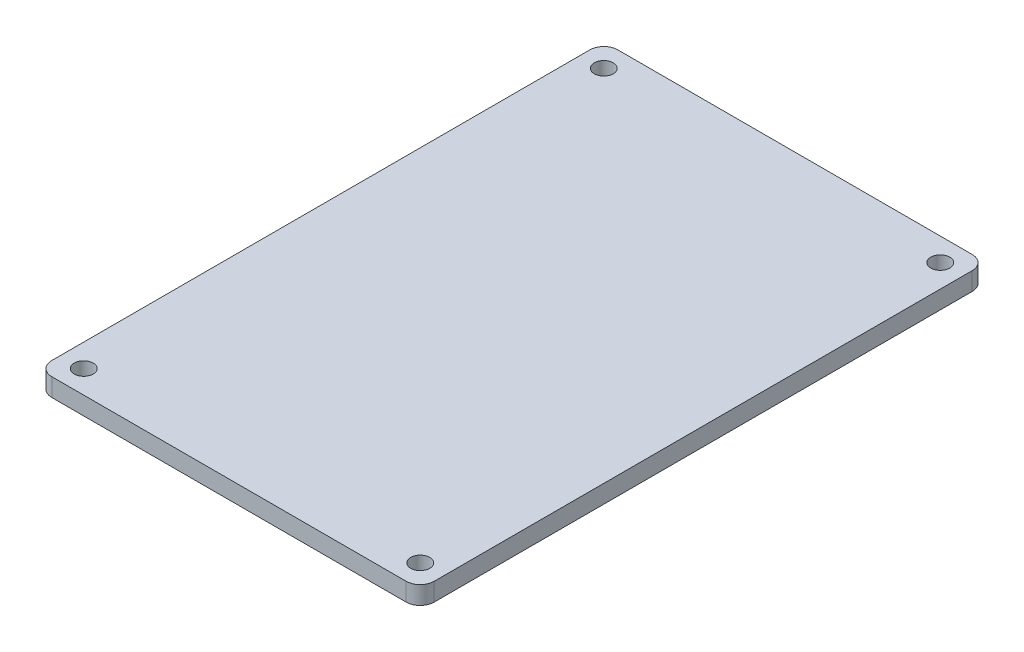
ISO-10303-21;
HEADER;
FILE_DESCRIPTION(('STEP AP214'),'2;1');
FILE_NAME('part.step','',(''),(''),'','','');
FILE_SCHEMA(('AUTOMOTIVE_DESIGN { 1 0 10303 214 1 1 1 1 }'));
ENDSEC;
DATA;
#1=APPLICATION_CONTEXT('core data for automotive mechanical design processes');
#2=APPLICATION_PROTOCOL_DEFINITION('international standard','automotive_design',2000,#1);
#3=PRODUCT_CONTEXT('',#1,'mechanical');
#4=PRODUCT('Part','Part','',(#3));
#5=PRODUCT_RELATED_PRODUCT_CATEGORY('part','',(#4));
#6=PRODUCT_DEFINITION_FORMATION('','',#4);
#7=PRODUCT_DEFINITION_CONTEXT('part definition',#1,'design');
#8=PRODUCT_DEFINITION('design','',#6,#7);
#9=PRODUCT_DEFINITION_SHAPE('','',#8);
#10=(LENGTH_UNIT() NAMED_UNIT(*) SI_UNIT(.MILLI.,.METRE.));
#11=(NAMED_UNIT(*) PLANE_ANGLE_UNIT() SI_UNIT($,.RADIAN.));
#12=(NAMED_UNIT(*) SI_UNIT($,.STERADIAN.) SOLID_ANGLE_UNIT());
#13=UNCERTAINTY_MEASURE_WITH_UNIT(LENGTH_MEASURE(1.E-05),#10,'distance_accuracy_value','');
#14=(GEOMETRIC_REPRESENTATION_CONTEXT(3) GLOBAL_UNCERTAINTY_ASSIGNED_CONTEXT((#13)) GLOBAL_UNIT_ASSIGNED_CONTEXT((#10,
#11,#12)) REPRESENTATION_CONTEXT('',''));
#15=CARTESIAN_POINT('',(0.,0.,0.));
#16=DIRECTION('',(0.,0.,1.));
#17=DIRECTION('',(1.,0.,0.));
#18=AXIS2_PLACEMENT_3D('',#15,#16,#17);
#19=CARTESIAN_POINT('',(-29.43,3.,44.68));
#20=DIRECTION('',(0.,-1.,0.));
#21=DIRECTION('',(0.,0.,-1.));
#22=AXIS2_PLACEMENT_3D('',#19,#20,#21);
#23=PLANE('',#22);
#24=CARTESIAN_POINT('',(27.94,3.,-43.18));
#25=DIRECTION('',(0.,1.,0.));
#26=DIRECTION('',(0.,0.,1.));
#27=AXIS2_PLACEMENT_3D('',#24,#25,#26);
#28=CIRCLE('',#27,1.58);
#29=CARTESIAN_POINT('',(27.94,3.,-41.6));
#30=VERTEX_POINT('',#29);
#31=EDGE_CURVE('E236',#30,#30,#28,.T.);
#32=ORIENTED_EDGE('',*,*,#31,.F.);
#33=EDGE_LOOP('',(#32));
#34=FACE_BOUND('',#33,.T.);
#35=CARTESIAN_POINT('',(-27.94,3.,-43.18));
#36=DIRECTION('',(0.,1.,0.));
#37=DIRECTION('',(0.,0.,1.));
#38=AXIS2_PLACEMENT_3D('',#35,#36,#37);
#39=CIRCLE('',#38,1.58);
#40=CARTESIAN_POINT('',(-27.94,3.,-41.6));
#41=VERTEX_POINT('',#40);
#42=EDGE_CURVE('E228',#41,#41,#39,.T.);
#43=ORIENTED_EDGE('',*,*,#42,.F.);
#44=EDGE_LOOP('',(#43));
#45=FACE_BOUND('',#44,.T.);
#46=CARTESIAN_POINT('',(27.94,3.,43.18));
#47=DIRECTION('',(0.,1.,0.));
#48=DIRECTION('',(0.,0.,1.));
#49=AXIS2_PLACEMENT_3D('',#46,#47,#48);
#50=CIRCLE('',#49,1.58);
#51=CARTESIAN_POINT('',(27.94,3.,44.76));
#52=VERTEX_POINT('',#51);
#53=EDGE_CURVE('E212',#52,#52,#50,.T.);
#54=ORIENTED_EDGE('',*,*,#53,.F.);
#55=EDGE_LOOP('',(#54));
#56=FACE_BOUND('',#55,.T.);
#57=CARTESIAN_POINT('',(-29.43,3.,44.68));
#58=DIRECTION('',(0.,1.,0.));
#59=DIRECTION('',(0.,0.,-1.));
#60=AXIS2_PLACEMENT_3D('',#57,#58,#59);
#61=CIRCLE('',#60,2.32);
#62=CARTESIAN_POINT('',(-31.75,3.,44.68));
#63=VERTEX_POINT('',#62);
#64=CARTESIAN_POINT('',(-29.43,3.,47.));
#65=VERTEX_POINT('',#64);
#66=EDGE_CURVE('E164',#63,#65,#61,.T.);
#67=ORIENTED_EDGE('',*,*,#66,.T.);
#68=DIRECTION('',(1.,0.,0.));
#69=VECTOR('',#68,1.);
#70=CARTESIAN_POINT('',(-29.43,3.,47.));
#71=LINE('',#70,#69);
#72=CARTESIAN_POINT('',(29.43,3.,47.));
#73=VERTEX_POINT('',#72);
#74=EDGE_CURVE('E100',#65,#73,#71,.T.);
#75=ORIENTED_EDGE('',*,*,#74,.T.);
#76=CARTESIAN_POINT('',(29.43,3.,44.68));
#77=DIRECTION('',(0.,1.,0.));
#78=DIRECTION('',(0.,0.,1.));
#79=AXIS2_PLACEMENT_3D('',#76,#77,#78);
#80=CIRCLE('',#79,2.32);
#81=CARTESIAN_POINT('',(31.75,3.,44.68));
#82=VERTEX_POINT('',#81);
#83=EDGE_CURVE('E185',#73,#82,#80,.T.);
#84=ORIENTED_EDGE('',*,*,#83,.T.);
#85=DIRECTION('',(0.,0.,-1.));
#86=VECTOR('',#85,1.);
#87=CARTESIAN_POINT('',(31.75,3.,44.68));
#88=LINE('',#87,#86);
#89=CARTESIAN_POINT('',(31.75,3.,-44.68));
#90=VERTEX_POINT('',#89);
#91=EDGE_CURVE('E199',#82,#90,#88,.T.);
#92=ORIENTED_EDGE('',*,*,#91,.T.);
#93=CARTESIAN_POINT('',(29.43,3.,-44.68));
#94=DIRECTION('',(0.,1.,0.));
#95=DIRECTION('',(0.,0.,-1.));
#96=AXIS2_PLACEMENT_3D('',#93,#94,#95);
#97=CIRCLE('',#96,2.32);
#98=CARTESIAN_POINT('',(29.43,3.,-47.));
#99=VERTEX_POINT('',#98);
#100=EDGE_CURVE('E119',#90,#99,#97,.T.);
#101=ORIENTED_EDGE('',*,*,#100,.T.);
#102=DIRECTION('',(-1.,0.,0.));
#103=VECTOR('',#102,1.);
#104=CARTESIAN_POINT('',(-29.43,3.,-47.));
#105=LINE('',#104,#103);
#106=CARTESIAN_POINT('',(-29.43,3.,-47.));
#107=VERTEX_POINT('',#106);
#108=EDGE_CURVE('E113',#99,#107,#105,.T.);
#109=ORIENTED_EDGE('',*,*,#108,.T.);
#110=CARTESIAN_POINT('',(-29.43,3.,-44.68));
#111=DIRECTION('',(0.,1.,0.));
#112=DIRECTION('',(0.,0.,1.));
#113=AXIS2_PLACEMENT_3D('',#110,#111,#112);
#114=CIRCLE('',#113,2.32);
#115=CARTESIAN_POINT('',(-31.75,3.,-44.68));
#116=VERTEX_POINT('',#115);
#117=EDGE_CURVE('E117',#107,#116,#114,.T.);
#118=ORIENTED_EDGE('',*,*,#117,.T.);
#119=DIRECTION('',(0.,0.,1.));
#120=VECTOR('',#119,1.);
#121=CARTESIAN_POINT('',(-31.75,3.,44.68));
#122=LINE('',#121,#120);
#123=EDGE_CURVE('E57',#116,#63,#122,.T.);
#124=ORIENTED_EDGE('',*,*,#123,.T.);
#125=EDGE_LOOP('',(#67,#75,#84,#92,#101,#109,#118,#124));
#126=FACE_BOUND('',#125,.T.);
#127=CARTESIAN_POINT('',(-27.94,3.,43.18));
#128=DIRECTION('',(0.,1.,0.));
#129=DIRECTION('',(0.,0.,1.));
#130=AXIS2_PLACEMENT_3D('',#127,#128,#129);
#131=CIRCLE('',#130,1.58);
#132=CARTESIAN_POINT('',(-27.94,3.,44.76));
#133=VERTEX_POINT('',#132);
#134=EDGE_CURVE('E220',#133,#133,#131,.T.);
#135=ORIENTED_EDGE('',*,*,#134,.F.);
#136=EDGE_LOOP('',(#135));
#137=FACE_BOUND('',#136,.T.);
#138=ADVANCED_FACE('F39',(#34,#45,#56,#126,#137),#23,.F.);
#139=CARTESIAN_POINT('',(-29.43,0.,44.68));
#140=DIRECTION('',(0.,-1.,0.));
#141=DIRECTION('',(0.,0.,-1.));
#142=AXIS2_PLACEMENT_3D('',#139,#140,#141);
#143=PLANE('',#142);
#144=CARTESIAN_POINT('',(27.94,0.,-43.18));
#145=DIRECTION('',(0.,1.,0.));
#146=DIRECTION('',(0.,0.,1.));
#147=AXIS2_PLACEMENT_3D('',#144,#145,#146);
#148=CIRCLE('',#147,1.58);
#149=CARTESIAN_POINT('',(27.94,0.,-41.6));
#150=VERTEX_POINT('',#149);
#151=EDGE_CURVE('E232',#150,#150,#148,.T.);
#152=ORIENTED_EDGE('',*,*,#151,.T.);
#153=EDGE_LOOP('',(#152));
#154=FACE_BOUND('',#153,.T.);
#155=CARTESIAN_POINT('',(-27.94,0.,-43.18));
#156=DIRECTION('',(0.,1.,0.));
#157=DIRECTION('',(0.,0.,1.));
#158=AXIS2_PLACEMENT_3D('',#155,#156,#157);
#159=CIRCLE('',#158,1.58);
#160=CARTESIAN_POINT('',(-27.94,0.,-41.6));
#161=VERTEX_POINT('',#160);
#162=EDGE_CURVE('E224',#161,#161,#159,.T.);
#163=ORIENTED_EDGE('',*,*,#162,.T.);
#164=EDGE_LOOP('',(#163));
#165=FACE_BOUND('',#164,.T.);
#166=CARTESIAN_POINT('',(-27.94,0.,43.18));
#167=DIRECTION('',(0.,1.,0.));
#168=DIRECTION('',(0.,0.,1.));
#169=AXIS2_PLACEMENT_3D('',#166,#167,#168);
#170=CIRCLE('',#169,1.58);
#171=CARTESIAN_POINT('',(-27.94,0.,44.76));
#172=VERTEX_POINT('',#171);
#173=EDGE_CURVE('E216',#172,#172,#170,.T.);
#174=ORIENTED_EDGE('',*,*,#173,.T.);
#175=EDGE_LOOP('',(#174));
#176=FACE_BOUND('',#175,.T.);
#177=CARTESIAN_POINT('',(-29.43,0.,44.68));
#178=DIRECTION('',(0.,1.,0.));
#179=DIRECTION('',(0.,0.,-1.));
#180=AXIS2_PLACEMENT_3D('',#177,#178,#179);
#181=CIRCLE('',#180,2.32);
#182=CARTESIAN_POINT('',(-31.75,0.,44.68));
#183=VERTEX_POINT('',#182);
#184=CARTESIAN_POINT('',(-29.43,0.,47.));
#185=VERTEX_POINT('',#184);
#186=EDGE_CURVE('E141',#183,#185,#181,.T.);
#187=ORIENTED_EDGE('',*,*,#186,.F.);
#188=DIRECTION('',(0.,0.,1.));
#189=VECTOR('',#188,1.);
#190=CARTESIAN_POINT('',(-31.75,0.,44.68));
#191=LINE('',#190,#189);
#192=CARTESIAN_POINT('',(-31.75,0.,-44.68));
#193=VERTEX_POINT('',#192);
#194=EDGE_CURVE('E92',#193,#183,#191,.T.);
#195=ORIENTED_EDGE('',*,*,#194,.F.);
#196=CARTESIAN_POINT('',(-29.43,0.,-44.68));
#197=DIRECTION('',(0.,1.,0.));
#198=DIRECTION('',(0.,0.,1.));
#199=AXIS2_PLACEMENT_3D('',#196,#197,#198);
#200=CIRCLE('',#199,2.32);
#201=CARTESIAN_POINT('',(-29.43,0.,-47.));
#202=VERTEX_POINT('',#201);
#203=EDGE_CURVE('E86',#202,#193,#200,.T.);
#204=ORIENTED_EDGE('',*,*,#203,.F.);
#205=DIRECTION('',(-1.,0.,0.));
#206=VECTOR('',#205,1.);
#207=CARTESIAN_POINT('',(-29.43,0.,-47.));
#208=LINE('',#207,#206);
#209=CARTESIAN_POINT('',(29.43,0.,-47.));
#210=VERTEX_POINT('',#209);
#211=EDGE_CURVE('E128',#210,#202,#208,.T.);
#212=ORIENTED_EDGE('',*,*,#211,.F.);
#213=CARTESIAN_POINT('',(29.43,0.,-44.68));
#214=DIRECTION('',(0.,1.,0.));
#215=DIRECTION('',(0.,0.,-1.));
#216=AXIS2_PLACEMENT_3D('',#213,#214,#215);
#217=CIRCLE('',#216,2.32);
#218=CARTESIAN_POINT('',(31.75,0.,-44.68));
#219=VERTEX_POINT('',#218);
#220=EDGE_CURVE('E155',#219,#210,#217,.T.);
#221=ORIENTED_EDGE('',*,*,#220,.F.);
#222=DIRECTION('',(0.,0.,-1.));
#223=VECTOR('',#222,1.);
#224=CARTESIAN_POINT('',(31.75,0.,44.68));
#225=LINE('',#224,#223);
#226=CARTESIAN_POINT('',(31.75,0.,44.68));
#227=VERTEX_POINT('',#226);
#228=EDGE_CURVE('E152',#227,#219,#225,.T.);
#229=ORIENTED_EDGE('',*,*,#228,.F.);
#230=CARTESIAN_POINT('',(29.43,0.,44.68));
#231=DIRECTION('',(0.,1.,0.));
#232=DIRECTION('',(0.,0.,1.));
#233=AXIS2_PLACEMENT_3D('',#230,#231,#232);
#234=CIRCLE('',#233,2.32);
#235=CARTESIAN_POINT('',(29.43,0.,47.));
#236=VERTEX_POINT('',#235);
#237=EDGE_CURVE('E149',#236,#227,#234,.T.);
#238=ORIENTED_EDGE('',*,*,#237,.F.);
#239=DIRECTION('',(1.,0.,0.));
#240=VECTOR('',#239,1.);
#241=CARTESIAN_POINT('',(-29.43,0.,47.));
#242=LINE('',#241,#240);
#243=EDGE_CURVE('E145',#185,#236,#242,.T.);
#244=ORIENTED_EDGE('',*,*,#243,.F.);
#245=EDGE_LOOP('',(#187,#195,#204,#212,#221,#229,#238,#244));
#246=FACE_BOUND('',#245,.T.);
#247=CARTESIAN_POINT('',(27.94,0.,43.18));
#248=DIRECTION('',(0.,1.,0.));
#249=DIRECTION('',(0.,0.,1.));
#250=AXIS2_PLACEMENT_3D('',#247,#248,#249);
#251=CIRCLE('',#250,1.58);
#252=CARTESIAN_POINT('',(27.94,0.,44.76));
#253=VERTEX_POINT('',#252);
#254=EDGE_CURVE('E146',#253,#253,#251,.T.);
#255=ORIENTED_EDGE('',*,*,#254,.T.);
#256=EDGE_LOOP('',(#255));
#257=FACE_BOUND('',#256,.T.);
#258=ADVANCED_FACE('F189',(#154,#165,#176,#246,#257),#143,.T.);
#259=CARTESIAN_POINT('',(-29.43,3.,44.68));
#260=DIRECTION('',(0.,-1.,0.));
#261=DIRECTION('',(0.,0.,-1.));
#262=AXIS2_PLACEMENT_3D('',#259,#260,#261);
#263=CYLINDRICAL_SURFACE('',#262,2.32);
#264=ORIENTED_EDGE('',*,*,#186,.T.);
#265=DIRECTION('',(0.,-1.,0.));
#266=VECTOR('',#265,1.);
#267=CARTESIAN_POINT('',(-29.43,3.,47.));
#268=LINE('',#267,#266);
#269=EDGE_CURVE('E11',#65,#185,#268,.T.);
#270=ORIENTED_EDGE('',*,*,#269,.F.);
#271=ORIENTED_EDGE('',*,*,#66,.F.);
#272=DIRECTION('',(0.,-1.,0.));
#273=VECTOR('',#272,1.);
#274=CARTESIAN_POINT('',(-31.75,3.,44.68));
#275=LINE('',#274,#273);
#276=EDGE_CURVE('E137',#63,#183,#275,.T.);
#277=ORIENTED_EDGE('',*,*,#276,.T.);
#278=EDGE_LOOP('',(#264,#270,#271,#277));
#279=FACE_BOUND('',#278,.T.);
#280=ADVANCED_FACE('F41',(#279),#263,.T.);
#281=CARTESIAN_POINT('',(-29.43,3.,47.));
#282=DIRECTION('',(0.,0.,-1.));
#283=DIRECTION('',(-1.,0.,0.));
#284=AXIS2_PLACEMENT_3D('',#281,#282,#283);
#285=PLANE('',#284);
#286=ORIENTED_EDGE('',*,*,#243,.T.);
#287=DIRECTION('',(0.,-1.,0.));
#288=VECTOR('',#287,1.);
#289=CARTESIAN_POINT('',(29.43,3.,47.));
#290=LINE('',#289,#288);
#291=EDGE_CURVE('E49',#73,#236,#290,.T.);
#292=ORIENTED_EDGE('',*,*,#291,.F.);
#293=ORIENTED_EDGE('',*,*,#74,.F.);
#294=ORIENTED_EDGE('',*,*,#269,.T.);
#295=EDGE_LOOP('',(#286,#292,#293,#294));
#296=FACE_BOUND('',#295,.T.);
#297=ADVANCED_FACE('F279',(#296),#285,.F.);
#298=CARTESIAN_POINT('',(29.43,3.,44.68));
#299=DIRECTION('',(0.,-1.,0.));
#300=DIRECTION('',(0.,0.,-1.));
#301=AXIS2_PLACEMENT_3D('',#298,#299,#300);
#302=CYLINDRICAL_SURFACE('',#301,2.32);
#303=ORIENTED_EDGE('',*,*,#237,.T.);
#304=DIRECTION('',(0.,-1.,0.));
#305=VECTOR('',#304,1.);
#306=CARTESIAN_POINT('',(31.75,3.,44.68));
#307=LINE('',#306,#305);
#308=EDGE_CURVE('E175',#82,#227,#307,.T.);
#309=ORIENTED_EDGE('',*,*,#308,.F.);
#310=ORIENTED_EDGE('',*,*,#83,.F.);
#311=ORIENTED_EDGE('',*,*,#291,.T.);
#312=EDGE_LOOP('',(#303,#309,#310,#311));
#313=FACE_BOUND('',#312,.T.);
#314=ADVANCED_FACE('F183',(#313),#302,.T.);
#315=CARTESIAN_POINT('',(31.75,3.,44.68));
#316=DIRECTION('',(-1.,0.,0.));
#317=DIRECTION('',(0.,0.,1.));
#318=AXIS2_PLACEMENT_3D('',#315,#316,#317);
#319=PLANE('',#318);
#320=ORIENTED_EDGE('',*,*,#228,.T.);
#321=DIRECTION('',(0.,-1.,0.));
#322=VECTOR('',#321,1.);
#323=CARTESIAN_POINT('',(31.75,3.,-44.68));
#324=LINE('',#323,#322);
#325=EDGE_CURVE('E171',#90,#219,#324,.T.);
#326=ORIENTED_EDGE('',*,*,#325,.F.);
#327=ORIENTED_EDGE('',*,*,#91,.F.);
#328=ORIENTED_EDGE('',*,*,#308,.T.);
#329=EDGE_LOOP('',(#320,#326,#327,#328));
#330=FACE_BOUND('',#329,.T.);
#331=ADVANCED_FACE('F194',(#330),#319,.F.);
#332=CARTESIAN_POINT('',(29.43,3.,-44.68));
#333=DIRECTION('',(0.,-1.,0.));
#334=DIRECTION('',(0.,0.,-1.));
#335=AXIS2_PLACEMENT_3D('',#332,#333,#334);
#336=CYLINDRICAL_SURFACE('',#335,2.32);
#337=ORIENTED_EDGE('',*,*,#220,.T.);
#338=DIRECTION('',(0.,-1.,0.));
#339=VECTOR('',#338,1.);
#340=CARTESIAN_POINT('',(29.43,3.,-47.));
#341=LINE('',#340,#339);
#342=EDGE_CURVE('E130',#99,#210,#341,.T.);
#343=ORIENTED_EDGE('',*,*,#342,.F.);
#344=ORIENTED_EDGE('',*,*,#100,.F.);
#345=ORIENTED_EDGE('',*,*,#325,.T.);
#346=EDGE_LOOP('',(#337,#343,#344,#345));
#347=FACE_BOUND('',#346,.T.);
#348=ADVANCED_FACE('F197',(#347),#336,.T.);
#349=CARTESIAN_POINT('',(-29.43,3.,-47.));
#350=DIRECTION('',(0.,0.,1.));
#351=DIRECTION('',(1.,0.,0.));
#352=AXIS2_PLACEMENT_3D('',#349,#350,#351);
#353=PLANE('',#352);
#354=ORIENTED_EDGE('',*,*,#211,.T.);
#355=DIRECTION('',(0.,-1.,0.));
#356=VECTOR('',#355,1.);
#357=CARTESIAN_POINT('',(-29.43,3.,-47.));
#358=LINE('',#357,#356);
#359=EDGE_CURVE('E125',#107,#202,#358,.T.);
#360=ORIENTED_EDGE('',*,*,#359,.F.);
#361=ORIENTED_EDGE('',*,*,#108,.F.);
#362=ORIENTED_EDGE('',*,*,#342,.T.);
#363=EDGE_LOOP('',(#354,#360,#361,#362));
#364=FACE_BOUND('',#363,.T.);
#365=ADVANCED_FACE('F126',(#364),#353,.F.);
#366=CARTESIAN_POINT('',(-29.43,3.,-44.68));
#367=DIRECTION('',(0.,-1.,0.));
#368=DIRECTION('',(0.,0.,-1.));
#369=AXIS2_PLACEMENT_3D('',#366,#367,#368);
#370=CYLINDRICAL_SURFACE('',#369,2.32);
#371=ORIENTED_EDGE('',*,*,#203,.T.);
#372=DIRECTION('',(0.,-1.,0.));
#373=VECTOR('',#372,1.);
#374=CARTESIAN_POINT('',(-31.75,3.,-44.68));
#375=LINE('',#374,#373);
#376=EDGE_CURVE('E131',#116,#193,#375,.T.);
#377=ORIENTED_EDGE('',*,*,#376,.F.);
#378=ORIENTED_EDGE('',*,*,#117,.F.);
#379=ORIENTED_EDGE('',*,*,#359,.T.);
#380=EDGE_LOOP('',(#371,#377,#378,#379));
#381=FACE_BOUND('',#380,.T.);
#382=ADVANCED_FACE('F133',(#381),#370,.T.);
#383=CARTESIAN_POINT('',(-31.75,3.,44.68));
#384=DIRECTION('',(1.,0.,0.));
#385=DIRECTION('',(0.,0.,-1.));
#386=AXIS2_PLACEMENT_3D('',#383,#384,#385);
#387=PLANE('',#386);
#388=ORIENTED_EDGE('',*,*,#194,.T.);
#389=ORIENTED_EDGE('',*,*,#276,.F.);
#390=ORIENTED_EDGE('',*,*,#123,.F.);
#391=ORIENTED_EDGE('',*,*,#376,.T.);
#392=EDGE_LOOP('',(#388,#389,#390,#391));
#393=FACE_BOUND('',#392,.T.);
#394=ADVANCED_FACE('F253',(#393),#387,.F.);
#395=CARTESIAN_POINT('',(27.94,3.,43.18));
#396=DIRECTION('',(0.,1.,0.));
#397=DIRECTION('',(0.,0.,1.));
#398=AXIS2_PLACEMENT_3D('',#395,#396,#397);
#399=CYLINDRICAL_SURFACE('',#398,1.58);
#400=ORIENTED_EDGE('',*,*,#254,.F.);
#401=EDGE_LOOP('',(#400));
#402=FACE_BOUND('',#401,.T.);
#403=ORIENTED_EDGE('',*,*,#53,.T.);
#404=EDGE_LOOP('',(#403));
#405=FACE_BOUND('',#404,.T.);
#406=ADVANCED_FACE('F250',(#402,#405),#399,.F.);
#407=CARTESIAN_POINT('',(-27.94,3.,43.18));
#408=DIRECTION('',(0.,1.,0.));
#409=DIRECTION('',(0.,0.,1.));
#410=AXIS2_PLACEMENT_3D('',#407,#408,#409);
#411=CYLINDRICAL_SURFACE('',#410,1.58);
#412=ORIENTED_EDGE('',*,*,#173,.F.);
#413=EDGE_LOOP('',(#412));
#414=FACE_BOUND('',#413,.T.);
#415=ORIENTED_EDGE('',*,*,#134,.T.);
#416=EDGE_LOOP('',(#415));
#417=FACE_BOUND('',#416,.T.);
#418=ADVANCED_FACE('F252',(#414,#417),#411,.F.);
#419=CARTESIAN_POINT('',(-27.94,3.,-43.18));
#420=DIRECTION('',(0.,1.,0.));
#421=DIRECTION('',(0.,0.,1.));
#422=AXIS2_PLACEMENT_3D('',#419,#420,#421);
#423=CYLINDRICAL_SURFACE('',#422,1.58);
#424=ORIENTED_EDGE('',*,*,#162,.F.);
#425=EDGE_LOOP('',(#424));
#426=FACE_BOUND('',#425,.T.);
#427=ORIENTED_EDGE('',*,*,#42,.T.);
#428=EDGE_LOOP('',(#427));
#429=FACE_BOUND('',#428,.T.);
#430=ADVANCED_FACE('F260',(#426,#429),#423,.F.);
#431=CARTESIAN_POINT('',(27.94,3.,-43.18));
#432=DIRECTION('',(0.,1.,0.));
#433=DIRECTION('',(0.,0.,1.));
#434=AXIS2_PLACEMENT_3D('',#431,#432,#433);
#435=CYLINDRICAL_SURFACE('',#434,1.58);
#436=ORIENTED_EDGE('',*,*,#151,.F.);
#437=EDGE_LOOP('',(#436));
#438=FACE_BOUND('',#437,.T.);
#439=ORIENTED_EDGE('',*,*,#31,.T.);
#440=EDGE_LOOP('',(#439));
#441=FACE_BOUND('',#440,.T.);
#442=ADVANCED_FACE('F241',(#438,#441),#435,.F.);
#443=CLOSED_SHELL('',(#138,#258,#280,#297,#314,#331,#348,#365,#382,#394,#406,#418,#430,#442));
#444=MANIFOLD_SOLID_BREP('B2',#443);
#445=ADVANCED_BREP_SHAPE_REPRESENTATION('',(#18,#444),#14);
#446=SHAPE_DEFINITION_REPRESENTATION(#9,#445);
ENDSEC;
END-ISO-10303-21;
